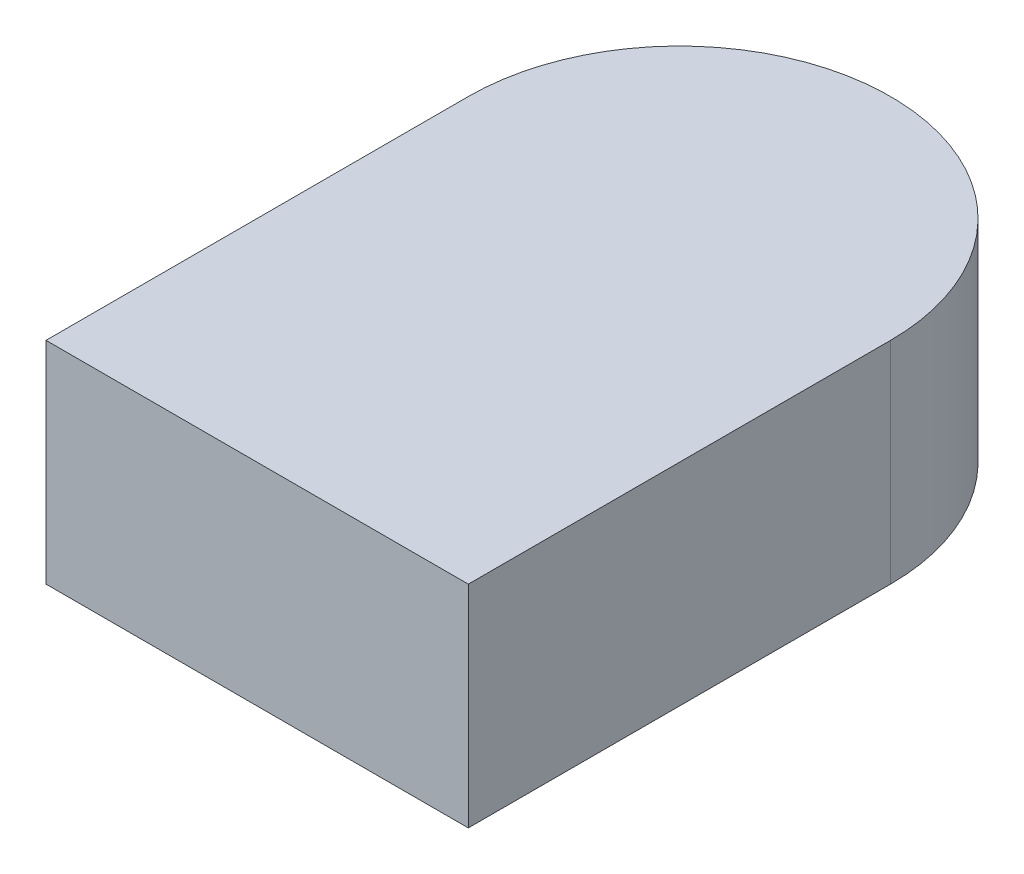
ISO-10303-21;
HEADER;
FILE_DESCRIPTION(('STEP AP214'),'2;1');
FILE_NAME('part.step','',(''),(''),'','','');
FILE_SCHEMA(('AUTOMOTIVE_DESIGN { 1 0 10303 214 1 1 1 1 }'));
ENDSEC;
DATA;
#1=APPLICATION_CONTEXT('core data for automotive mechanical design processes');
#2=APPLICATION_PROTOCOL_DEFINITION('international standard','automotive_design',2000,#1);
#3=PRODUCT_CONTEXT('',#1,'mechanical');
#4=PRODUCT('Part','Part','',(#3));
#5=PRODUCT_RELATED_PRODUCT_CATEGORY('part','',(#4));
#6=PRODUCT_DEFINITION_FORMATION('','',#4);
#7=PRODUCT_DEFINITION_CONTEXT('part definition',#1,'design');
#8=PRODUCT_DEFINITION('design','',#6,#7);
#9=PRODUCT_DEFINITION_SHAPE('','',#8);
#10=(LENGTH_UNIT() NAMED_UNIT(*) SI_UNIT(.MILLI.,.METRE.));
#11=(NAMED_UNIT(*) PLANE_ANGLE_UNIT() SI_UNIT($,.RADIAN.));
#12=(NAMED_UNIT(*) SI_UNIT($,.STERADIAN.) SOLID_ANGLE_UNIT());
#13=UNCERTAINTY_MEASURE_WITH_UNIT(LENGTH_MEASURE(1.E-05),#10,'distance_accuracy_value','');
#14=(GEOMETRIC_REPRESENTATION_CONTEXT(3) GLOBAL_UNCERTAINTY_ASSIGNED_CONTEXT((#13)) GLOBAL_UNIT_ASSIGNED_CONTEXT((#10,
#11,#12)) REPRESENTATION_CONTEXT('',''));
#15=CARTESIAN_POINT('',(0.,0.,0.));
#16=DIRECTION('',(0.,0.,1.));
#17=DIRECTION('',(1.,0.,0.));
#18=AXIS2_PLACEMENT_3D('',#15,#16,#17);
#19=CARTESIAN_POINT('',(0.,0.,0.));
#20=DIRECTION('',(0.,-1.,0.));
#21=DIRECTION('',(1.,0.,0.));
#22=AXIS2_PLACEMENT_3D('',#19,#20,#21);
#23=PLANE('',#22);
#24=CARTESIAN_POINT('',(-0.4,0.,2.05));
#25=DIRECTION('',(0.,-1.,0.));
#26=DIRECTION('',(-1.,0.,0.));
#27=AXIS2_PLACEMENT_3D('',#24,#25,#26);
#28=CIRCLE('',#27,0.1);
#29=CARTESIAN_POINT('',(-0.5,0.,2.05));
#30=VERTEX_POINT('',#29);
#31=CARTESIAN_POINT('',(-0.3,0.,2.05));
#32=VERTEX_POINT('',#31);
#33=EDGE_CURVE('E11',#30,#32,#28,.T.);
#34=ORIENTED_EDGE('',*,*,#33,.T.);
#35=DIRECTION('',(0.,0.,1.));
#36=VECTOR('',#35,1.);
#37=CARTESIAN_POINT('',(-0.3,0.,2.05));
#38=LINE('',#37,#36);
#39=CARTESIAN_POINT('',(-0.3,0.,2.25));
#40=VERTEX_POINT('',#39);
#41=EDGE_CURVE('E25',#32,#40,#38,.T.);
#42=ORIENTED_EDGE('',*,*,#41,.T.);
#43=DIRECTION('',(-1.,0.,0.));
#44=VECTOR('',#43,1.);
#45=CARTESIAN_POINT('',(-0.3,0.,2.25));
#46=LINE('',#45,#44);
#47=CARTESIAN_POINT('',(-0.5,0.,2.25));
#48=VERTEX_POINT('',#47);
#49=EDGE_CURVE('E73',#40,#48,#46,.T.);
#50=ORIENTED_EDGE('',*,*,#49,.T.);
#51=DIRECTION('',(0.,0.,-1.));
#52=VECTOR('',#51,1.);
#53=CARTESIAN_POINT('',(-0.5,0.,2.25));
#54=LINE('',#53,#52);
#55=EDGE_CURVE('E99',#48,#30,#54,.T.);
#56=ORIENTED_EDGE('',*,*,#55,.T.);
#57=EDGE_LOOP('',(#34,#42,#50,#56));
#58=FACE_BOUND('',#57,.T.);
#59=ADVANCED_FACE('F17',(#58),#23,.T.);
#60=CARTESIAN_POINT('',(-0.5,0.,2.25));
#61=DIRECTION('',(1.,0.,0.));
#62=DIRECTION('',(0.,0.,-1.));
#63=AXIS2_PLACEMENT_3D('',#60,#61,#62);
#64=PLANE('',#63);
#65=DIRECTION('',(0.,1.,0.));
#66=VECTOR('',#65,1.);
#67=CARTESIAN_POINT('',(-0.5,0.,2.25));
#68=LINE('',#67,#66);
#69=CARTESIAN_POINT('',(-0.5,0.1,2.25));
#70=VERTEX_POINT('',#69);
#71=EDGE_CURVE('E95',#48,#70,#68,.T.);
#72=ORIENTED_EDGE('',*,*,#71,.T.);
#73=DIRECTION('',(0.,0.,-1.));
#74=VECTOR('',#73,1.);
#75=CARTESIAN_POINT('',(-0.5,0.1,2.25));
#76=LINE('',#75,#74);
#77=CARTESIAN_POINT('',(-0.5,0.1,2.05));
#78=VERTEX_POINT('',#77);
#79=EDGE_CURVE('E68',#70,#78,#76,.T.);
#80=ORIENTED_EDGE('',*,*,#79,.T.);
#81=DIRECTION('',(0.,1.,0.));
#82=VECTOR('',#81,1.);
#83=CARTESIAN_POINT('',(-0.5,0.,2.05));
#84=LINE('',#83,#82);
#85=EDGE_CURVE('E87',#30,#78,#84,.T.);
#86=ORIENTED_EDGE('',*,*,#85,.F.);
#87=ORIENTED_EDGE('',*,*,#55,.F.);
#88=EDGE_LOOP('',(#72,#80,#86,#87));
#89=FACE_BOUND('',#88,.T.);
#90=ADVANCED_FACE('F113',(#89),#64,.F.);
#91=CARTESIAN_POINT('',(-0.4,0.,2.05));
#92=DIRECTION('',(0.,-1.,0.));
#93=DIRECTION('',(0.,0.,1.));
#94=AXIS2_PLACEMENT_3D('',#91,#92,#93);
#95=CYLINDRICAL_SURFACE('',#94,0.1);
#96=ORIENTED_EDGE('',*,*,#85,.T.);
#97=CARTESIAN_POINT('',(-0.4,0.1,2.05));
#98=DIRECTION('',(0.,-1.,0.));
#99=DIRECTION('',(-1.,0.,0.));
#100=AXIS2_PLACEMENT_3D('',#97,#98,#99);
#101=CIRCLE('',#100,0.1);
#102=CARTESIAN_POINT('',(-0.3,0.1,2.05));
#103=VERTEX_POINT('',#102);
#104=EDGE_CURVE('E83',#78,#103,#101,.T.);
#105=ORIENTED_EDGE('',*,*,#104,.T.);
#106=DIRECTION('',(0.,1.,0.));
#107=VECTOR('',#106,1.);
#108=CARTESIAN_POINT('',(-0.3,0.,2.05));
#109=LINE('',#108,#107);
#110=EDGE_CURVE('E60',#32,#103,#109,.T.);
#111=ORIENTED_EDGE('',*,*,#110,.F.);
#112=ORIENTED_EDGE('',*,*,#33,.F.);
#113=EDGE_LOOP('',(#96,#105,#111,#112));
#114=FACE_BOUND('',#113,.T.);
#115=ADVANCED_FACE('F115',(#114),#95,.T.);
#116=CARTESIAN_POINT('',(-0.3,0.,2.05));
#117=DIRECTION('',(-1.,0.,0.));
#118=DIRECTION('',(0.,0.,1.));
#119=AXIS2_PLACEMENT_3D('',#116,#117,#118);
#120=PLANE('',#119);
#121=ORIENTED_EDGE('',*,*,#110,.T.);
#122=DIRECTION('',(0.,0.,1.));
#123=VECTOR('',#122,1.);
#124=CARTESIAN_POINT('',(-0.3,0.1,2.05));
#125=LINE('',#124,#123);
#126=CARTESIAN_POINT('',(-0.3,0.1,2.25));
#127=VERTEX_POINT('',#126);
#128=EDGE_CURVE('E53',#103,#127,#125,.T.);
#129=ORIENTED_EDGE('',*,*,#128,.T.);
#130=DIRECTION('',(0.,1.,0.));
#131=VECTOR('',#130,1.);
#132=CARTESIAN_POINT('',(-0.3,0.,2.25));
#133=LINE('',#132,#131);
#134=EDGE_CURVE('E57',#40,#127,#133,.T.);
#135=ORIENTED_EDGE('',*,*,#134,.F.);
#136=ORIENTED_EDGE('',*,*,#41,.F.);
#137=EDGE_LOOP('',(#121,#129,#135,#136));
#138=FACE_BOUND('',#137,.T.);
#139=ADVANCED_FACE('F55',(#138),#120,.F.);
#140=CARTESIAN_POINT('',(-0.3,0.,2.25));
#141=DIRECTION('',(0.,0.,-1.));
#142=DIRECTION('',(-1.,0.,0.));
#143=AXIS2_PLACEMENT_3D('',#140,#141,#142);
#144=PLANE('',#143);
#145=ORIENTED_EDGE('',*,*,#134,.T.);
#146=DIRECTION('',(-1.,0.,0.));
#147=VECTOR('',#146,1.);
#148=CARTESIAN_POINT('',(-0.3,0.1,2.25));
#149=LINE('',#148,#147);
#150=EDGE_CURVE('E66',#127,#70,#149,.T.);
#151=ORIENTED_EDGE('',*,*,#150,.T.);
#152=ORIENTED_EDGE('',*,*,#71,.F.);
#153=ORIENTED_EDGE('',*,*,#49,.F.);
#154=EDGE_LOOP('',(#145,#151,#152,#153));
#155=FACE_BOUND('',#154,.T.);
#156=ADVANCED_FACE('F72',(#155),#144,.F.);
#157=CARTESIAN_POINT('',(0.,0.1,0.));
#158=DIRECTION('',(0.,-1.,0.));
#159=DIRECTION('',(1.,0.,0.));
#160=AXIS2_PLACEMENT_3D('',#157,#158,#159);
#161=PLANE('',#160);
#162=ORIENTED_EDGE('',*,*,#150,.F.);
#163=ORIENTED_EDGE('',*,*,#128,.F.);
#164=ORIENTED_EDGE('',*,*,#104,.F.);
#165=ORIENTED_EDGE('',*,*,#79,.F.);
#166=EDGE_LOOP('',(#162,#163,#164,#165));
#167=FACE_BOUND('',#166,.T.);
#168=ADVANCED_FACE('F67',(#167),#161,.F.);
#169=CLOSED_SHELL('',(#59,#90,#115,#139,#156,#168));
#170=MANIFOLD_SOLID_BREP('B1',#169);
#171=ADVANCED_BREP_SHAPE_REPRESENTATION('',(#18,#170),#14);
#172=SHAPE_DEFINITION_REPRESENTATION(#9,#171);
ENDSEC;
END-ISO-10303-21;
